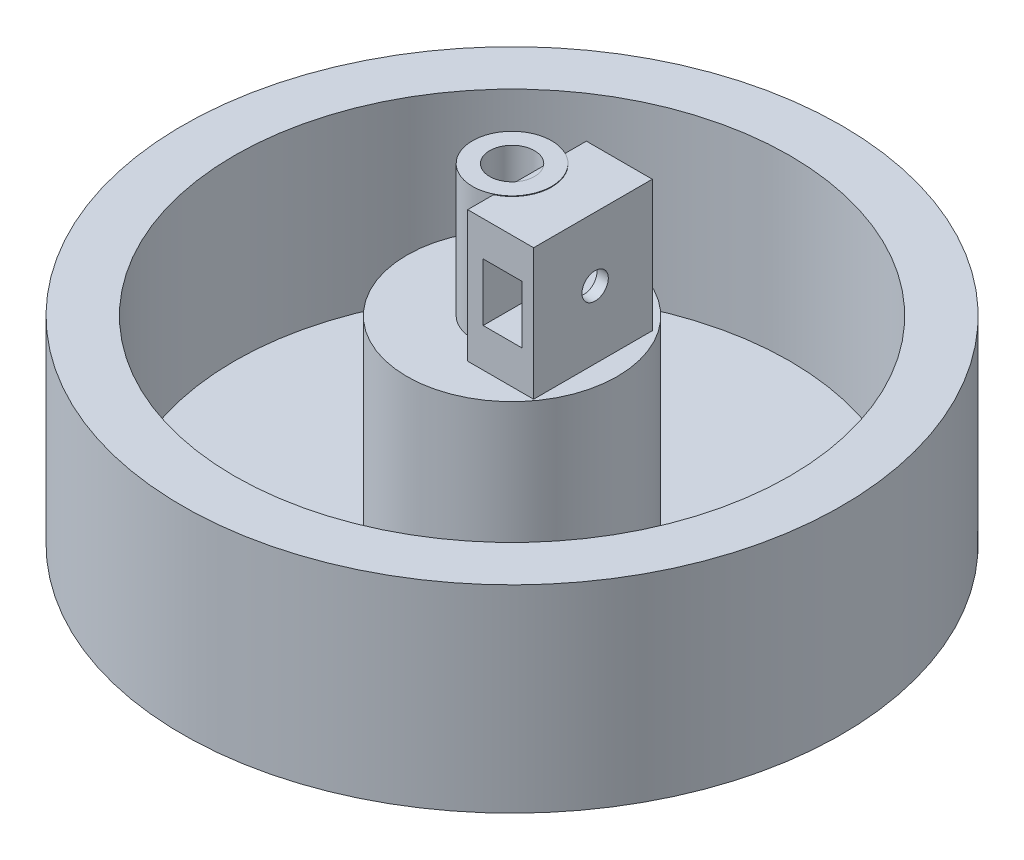
ISO-10303-21;
HEADER;
FILE_DESCRIPTION(('STEP AP214'),'2;1');
FILE_NAME('part.step','',(''),(''),'','','');
FILE_SCHEMA(('AUTOMOTIVE_DESIGN { 1 0 10303 214 1 1 1 1 }'));
ENDSEC;
DATA;
#1=APPLICATION_CONTEXT('core data for automotive mechanical design processes');
#2=APPLICATION_PROTOCOL_DEFINITION('international standard','automotive_design',2000,#1);
#3=PRODUCT_CONTEXT('',#1,'mechanical');
#4=PRODUCT('Part','Part','',(#3));
#5=PRODUCT_RELATED_PRODUCT_CATEGORY('part','',(#4));
#6=PRODUCT_DEFINITION_FORMATION('','',#4);
#7=PRODUCT_DEFINITION_CONTEXT('part definition',#1,'design');
#8=PRODUCT_DEFINITION('design','',#6,#7);
#9=PRODUCT_DEFINITION_SHAPE('','',#8);
#10=(LENGTH_UNIT() NAMED_UNIT(*) SI_UNIT(.MILLI.,.METRE.));
#11=(NAMED_UNIT(*) PLANE_ANGLE_UNIT() SI_UNIT($,.RADIAN.));
#12=(NAMED_UNIT(*) SI_UNIT($,.STERADIAN.) SOLID_ANGLE_UNIT());
#13=UNCERTAINTY_MEASURE_WITH_UNIT(LENGTH_MEASURE(1.E-05),#10,'distance_accuracy_value','');
#14=(GEOMETRIC_REPRESENTATION_CONTEXT(3) GLOBAL_UNCERTAINTY_ASSIGNED_CONTEXT((#13)) GLOBAL_UNIT_ASSIGNED_CONTEXT((#10,
#11,#12)) REPRESENTATION_CONTEXT('',''));
#15=CARTESIAN_POINT('',(0.,0.,0.));
#16=DIRECTION('',(0.,0.,1.));
#17=DIRECTION('',(1.,0.,0.));
#18=AXIS2_PLACEMENT_3D('',#15,#16,#17);
#19=CARTESIAN_POINT('',(0.,0.,0.));
#20=DIRECTION('',(0.,-1.,0.));
#21=DIRECTION('',(0.,0.,-1.));
#22=AXIS2_PLACEMENT_3D('',#19,#20,#21);
#23=PLANE('',#22);
#24=DIRECTION('',(0.,0.,1.));
#25=VECTOR('',#24,1.);
#26=CARTESIAN_POINT('',(2.6,0.,-8.67171590872573));
#27=LINE('',#26,#25);
#28=CARTESIAN_POINT('',(2.6,0.,5.40740233383831));
#29=VERTEX_POINT('',#28);
#30=CARTESIAN_POINT('',(2.6,0.,9.3322603304955));
#31=VERTEX_POINT('',#30);
#32=EDGE_CURVE('E159',#29,#31,#27,.T.);
#33=ORIENTED_EDGE('',*,*,#32,.F.);
#34=CARTESIAN_POINT('',(0.,0.,0.));
#35=DIRECTION('',(0.,1.,0.));
#36=DIRECTION('',(0.,0.,1.));
#37=AXIS2_PLACEMENT_3D('',#34,#35,#36);
#38=CIRCLE('',#37,6.);
#39=CARTESIAN_POINT('',(2.6,0.,-5.40740233383831));
#40=VERTEX_POINT('',#39);
#41=EDGE_CURVE('E189',#40,#29,#38,.T.);
#42=ORIENTED_EDGE('',*,*,#41,.F.);
#43=CARTESIAN_POINT('',(2.6,0.,-8.67171590872573));
#44=VERTEX_POINT('',#43);
#45=EDGE_CURVE('E161',#44,#40,#27,.T.);
#46=ORIENTED_EDGE('',*,*,#45,.F.);
#47=DIRECTION('',(-1.,0.,0.));
#48=VECTOR('',#47,1.);
#49=CARTESIAN_POINT('',(12.6,0.,-8.67171590872573));
#50=LINE('',#49,#48);
#51=CARTESIAN_POINT('',(12.6,0.,-8.67171590872573));
#52=VERTEX_POINT('',#51);
#53=EDGE_CURVE('E144',#52,#44,#50,.T.);
#54=ORIENTED_EDGE('',*,*,#53,.F.);
#55=DIRECTION('',(0.,0.,1.));
#56=VECTOR('',#55,1.);
#57=CARTESIAN_POINT('',(12.6,0.,-8.67171590872573));
#58=LINE('',#57,#56);
#59=CARTESIAN_POINT('',(12.6,0.,9.3322603304955));
#60=VERTEX_POINT('',#59);
#61=EDGE_CURVE('E128',#52,#60,#58,.T.);
#62=ORIENTED_EDGE('',*,*,#61,.T.);
#63=DIRECTION('',(-1.,0.,0.));
#64=VECTOR('',#63,1.);
#65=CARTESIAN_POINT('',(12.6,0.,9.3322603304955));
#66=LINE('',#65,#64);
#67=EDGE_CURVE('E136',#60,#31,#66,.T.);
#68=ORIENTED_EDGE('',*,*,#67,.T.);
#69=EDGE_LOOP('',(#33,#42,#46,#54,#62,#68));
#70=FACE_BOUND('',#69,.T.);
#71=CARTESIAN_POINT('',(0.,0.,0.));
#72=DIRECTION('',(0.,1.,0.));
#73=DIRECTION('',(0.,0.,1.));
#74=AXIS2_PLACEMENT_3D('',#71,#72,#73);
#75=CIRCLE('',#74,15.9579008899185);
#76=CARTESIAN_POINT('',(0.,0.,15.9579008899185));
#77=VERTEX_POINT('',#76);
#78=EDGE_CURVE('E313',#77,#77,#75,.T.);
#79=ORIENTED_EDGE('',*,*,#78,.T.);
#80=EDGE_LOOP('',(#79));
#81=FACE_BOUND('',#80,.T.);
#82=ADVANCED_FACE('F35',(#70,#81),#23,.F.);
#83=CARTESIAN_POINT('',(12.6,19.9099600410235,-8.67171590872573));
#84=DIRECTION('',(0.,0.,-1.));
#85=DIRECTION('',(0.,1.,0.));
#86=AXIS2_PLACEMENT_3D('',#83,#84,#85);
#87=PLANE('',#86);
#88=DIRECTION('',(0.,-1.,0.));
#89=VECTOR('',#88,1.);
#90=CARTESIAN_POINT('',(2.6,19.9099600410235,-8.67171590872573));
#91=LINE('',#90,#89);
#92=CARTESIAN_POINT('',(2.6,19.9099600410235,-8.67171590872573));
#93=VERTEX_POINT('',#92);
#94=EDGE_CURVE('E156',#93,#44,#91,.T.);
#95=ORIENTED_EDGE('',*,*,#94,.F.);
#96=DIRECTION('',(-1.,0.,0.));
#97=VECTOR('',#96,1.);
#98=CARTESIAN_POINT('',(12.6,19.9099600410235,-8.67171590872573));
#99=LINE('',#98,#97);
#100=CARTESIAN_POINT('',(12.6,19.9099600410235,-8.67171590872573));
#101=VERTEX_POINT('',#100);
#102=EDGE_CURVE('E167',#101,#93,#99,.T.);
#103=ORIENTED_EDGE('',*,*,#102,.F.);
#104=DIRECTION('',(0.,-1.,0.));
#105=VECTOR('',#104,1.);
#106=CARTESIAN_POINT('',(12.6,19.9099600410235,-8.67171590872573));
#107=LINE('',#106,#105);
#108=EDGE_CURVE('E149',#101,#52,#107,.T.);
#109=ORIENTED_EDGE('',*,*,#108,.T.);
#110=ORIENTED_EDGE('',*,*,#53,.T.);
#111=EDGE_LOOP('',(#95,#103,#109,#110));
#112=FACE_BOUND('',#111,.T.);
#113=DIRECTION('',(0.,1.,0.));
#114=VECTOR('',#113,1.);
#115=CARTESIAN_POINT('',(10.8765163816997,19.9099600410235,-8.67171590872573));
#116=LINE('',#115,#114);
#117=CARTESIAN_POINT('',(10.8765163816997,5.86192553685862,-8.67171590872573));
#118=VERTEX_POINT('',#117);
#119=CARTESIAN_POINT('',(10.8765163816997,14.6143324449,-8.67171590872573));
#120=VERTEX_POINT('',#119);
#121=EDGE_CURVE('E214',#118,#120,#116,.T.);
#122=ORIENTED_EDGE('',*,*,#121,.T.);
#123=DIRECTION('',(-1.,0.,0.));
#124=VECTOR('',#123,1.);
#125=CARTESIAN_POINT('',(12.6,14.6143324449,-8.67171590872573));
#126=LINE('',#125,#124);
#127=CARTESIAN_POINT('',(4.94343022694287,14.6143324449,-8.67171590872573));
#128=VERTEX_POINT('',#127);
#129=EDGE_CURVE('E206',#120,#128,#126,.T.);
#130=ORIENTED_EDGE('',*,*,#129,.T.);
#131=DIRECTION('',(0.,-1.,0.));
#132=VECTOR('',#131,1.);
#133=CARTESIAN_POINT('',(4.94343022694287,19.9099600410235,-8.67171590872573));
#134=LINE('',#133,#132);
#135=CARTESIAN_POINT('',(4.94343022694287,5.86192553685862,-8.67171590872573));
#136=VERTEX_POINT('',#135);
#137=EDGE_CURVE('E240',#128,#136,#134,.T.);
#138=ORIENTED_EDGE('',*,*,#137,.T.);
#139=DIRECTION('',(1.,0.,0.));
#140=VECTOR('',#139,1.);
#141=CARTESIAN_POINT('',(12.6,5.86192553685862,-8.67171590872573));
#142=LINE('',#141,#140);
#143=EDGE_CURVE('E224',#136,#118,#142,.T.);
#144=ORIENTED_EDGE('',*,*,#143,.T.);
#145=EDGE_LOOP('',(#122,#130,#138,#144));
#146=FACE_BOUND('',#145,.T.);
#147=ADVANCED_FACE('F264',(#112,#146),#87,.T.);
#148=CARTESIAN_POINT('',(12.6,19.9099600410235,9.3322603304955));
#149=DIRECTION('',(0.,0.,1.));
#150=DIRECTION('',(0.,-1.,0.));
#151=AXIS2_PLACEMENT_3D('',#148,#149,#150);
#152=PLANE('',#151);
#153=DIRECTION('',(0.,1.,0.));
#154=VECTOR('',#153,1.);
#155=CARTESIAN_POINT('',(2.6,19.9099600410235,9.3322603304955));
#156=LINE('',#155,#154);
#157=CARTESIAN_POINT('',(2.6,19.9099600410235,9.3322603304955));
#158=VERTEX_POINT('',#157);
#159=EDGE_CURVE('E140',#31,#158,#156,.T.);
#160=ORIENTED_EDGE('',*,*,#159,.F.);
#161=ORIENTED_EDGE('',*,*,#67,.F.);
#162=DIRECTION('',(0.,1.,0.));
#163=VECTOR('',#162,1.);
#164=CARTESIAN_POINT('',(12.6,19.9099600410235,9.3322603304955));
#165=LINE('',#164,#163);
#166=CARTESIAN_POINT('',(12.6,19.9099600410235,9.3322603304955));
#167=VERTEX_POINT('',#166);
#168=EDGE_CURVE('E123',#60,#167,#165,.T.);
#169=ORIENTED_EDGE('',*,*,#168,.T.);
#170=DIRECTION('',(-1.,0.,0.));
#171=VECTOR('',#170,1.);
#172=CARTESIAN_POINT('',(12.6,19.9099600410235,9.3322603304955));
#173=LINE('',#172,#171);
#174=EDGE_CURVE('E143',#167,#158,#173,.T.);
#175=ORIENTED_EDGE('',*,*,#174,.T.);
#176=EDGE_LOOP('',(#160,#161,#169,#175));
#177=FACE_BOUND('',#176,.T.);
#178=DIRECTION('',(0.,1.,0.));
#179=VECTOR('',#178,1.);
#180=CARTESIAN_POINT('',(4.94343022694287,19.9099600410235,9.3322603304955));
#181=LINE('',#180,#179);
#182=CARTESIAN_POINT('',(4.94343022694287,5.86192553685862,9.3322603304955));
#183=VERTEX_POINT('',#182);
#184=CARTESIAN_POINT('',(4.94343022694287,14.6143324449,9.3322603304955));
#185=VERTEX_POINT('',#184);
#186=EDGE_CURVE('E213',#183,#185,#181,.T.);
#187=ORIENTED_EDGE('',*,*,#186,.T.);
#188=DIRECTION('',(1.,0.,0.));
#189=VECTOR('',#188,1.);
#190=CARTESIAN_POINT('',(12.6,14.6143324449,9.3322603304955));
#191=LINE('',#190,#189);
#192=CARTESIAN_POINT('',(10.8765163816997,14.6143324449,9.3322603304955));
#193=VERTEX_POINT('',#192);
#194=EDGE_CURVE('E11',#185,#193,#191,.T.);
#195=ORIENTED_EDGE('',*,*,#194,.T.);
#196=DIRECTION('',(0.,-1.,0.));
#197=VECTOR('',#196,1.);
#198=CARTESIAN_POINT('',(10.8765163816997,19.9099600410235,9.3322603304955));
#199=LINE('',#198,#197);
#200=CARTESIAN_POINT('',(10.8765163816997,5.86192553685862,9.3322603304955));
#201=VERTEX_POINT('',#200);
#202=EDGE_CURVE('E210',#193,#201,#199,.T.);
#203=ORIENTED_EDGE('',*,*,#202,.T.);
#204=DIRECTION('',(-1.,0.,0.));
#205=VECTOR('',#204,1.);
#206=CARTESIAN_POINT('',(12.6,5.86192553685862,9.3322603304955));
#207=LINE('',#206,#205);
#208=EDGE_CURVE('E43',#201,#183,#207,.T.);
#209=ORIENTED_EDGE('',*,*,#208,.T.);
#210=EDGE_LOOP('',(#187,#195,#203,#209));
#211=FACE_BOUND('',#210,.T.);
#212=ADVANCED_FACE('F137',(#177,#211),#152,.T.);
#213=CARTESIAN_POINT('',(1.6,10.2369255368586,0.));
#214=DIRECTION('',(1.,0.,0.));
#215=DIRECTION('',(0.,0.,-1.));
#216=AXIS2_PLACEMENT_3D('',#213,#214,#215);
#217=CYLINDRICAL_SURFACE('',#216,2.);
#218=CARTESIAN_POINT('',(2.6,10.2369255368586,0.));
#219=DIRECTION('',(-1.,0.,0.));
#220=DIRECTION('',(0.,0.,1.));
#221=AXIS2_PLACEMENT_3D('',#218,#219,#220);
#222=CIRCLE('',#221,2.);
#223=CARTESIAN_POINT('',(2.6,10.2369255368586,2.));
#224=VERTEX_POINT('',#223);
#225=EDGE_CURVE('E160',#224,#224,#222,.F.);
#226=ORIENTED_EDGE('',*,*,#225,.F.);
#227=EDGE_LOOP('',(#226));
#228=FACE_BOUND('',#227,.T.);
#229=CARTESIAN_POINT('',(4.94343022694287,10.2369255368586,0.));
#230=DIRECTION('',(1.,0.,0.));
#231=DIRECTION('',(0.,0.,-1.));
#232=AXIS2_PLACEMENT_3D('',#229,#230,#231);
#233=CIRCLE('',#232,2.);
#234=CARTESIAN_POINT('',(4.94343022694287,10.2369255368586,-2.));
#235=VERTEX_POINT('',#234);
#236=EDGE_CURVE('E211',#235,#235,#233,.T.);
#237=ORIENTED_EDGE('',*,*,#236,.T.);
#238=EDGE_LOOP('',(#237));
#239=FACE_BOUND('',#238,.T.);
#240=ADVANCED_FACE('F250',(#228,#239),#217,.F.);
#241=CARTESIAN_POINT('',(12.6,10.2369255368586,0.));
#242=DIRECTION('',(-1.,0.,0.));
#243=DIRECTION('',(0.,0.,1.));
#244=AXIS2_PLACEMENT_3D('',#241,#242,#243);
#245=CIRCLE('',#244,2.);
#246=CARTESIAN_POINT('',(12.6,10.2369255368586,2.));
#247=VERTEX_POINT('',#246);
#248=EDGE_CURVE('E203',#247,#247,#245,.F.);
#249=ORIENTED_EDGE('',*,*,#248,.T.);
#250=EDGE_LOOP('',(#249));
#251=FACE_BOUND('',#250,.T.);
#252=CARTESIAN_POINT('',(10.8765163816997,10.2369255368586,0.));
#253=DIRECTION('',(-1.,0.,0.));
#254=DIRECTION('',(0.,0.,1.));
#255=AXIS2_PLACEMENT_3D('',#252,#253,#254);
#256=CIRCLE('',#255,2.);
#257=CARTESIAN_POINT('',(10.8765163816997,10.2369255368586,2.));
#258=VERTEX_POINT('',#257);
#259=EDGE_CURVE('E207',#258,#258,#256,.T.);
#260=ORIENTED_EDGE('',*,*,#259,.T.);
#261=EDGE_LOOP('',(#260));
#262=FACE_BOUND('',#261,.T.);
#263=ADVANCED_FACE('F253',(#251,#262),#217,.F.);
#264=CARTESIAN_POINT('',(0.,20.,0.));
#265=DIRECTION('',(0.,-1.,0.));
#266=DIRECTION('',(0.,0.,-1.));
#267=AXIS2_PLACEMENT_3D('',#264,#265,#266);
#268=CYLINDRICAL_SURFACE('',#267,6.);
#269=CARTESIAN_POINT('',(0.,20.,0.));
#270=DIRECTION('',(0.,1.,0.));
#271=DIRECTION('',(0.,0.,1.));
#272=AXIS2_PLACEMENT_3D('',#269,#270,#271);
#273=CIRCLE('',#272,6.);
#274=CARTESIAN_POINT('',(0.,20.,6.));
#275=VERTEX_POINT('',#274);
#276=EDGE_CURVE('E192',#275,#275,#273,.T.);
#277=ORIENTED_EDGE('',*,*,#276,.F.);
#278=EDGE_LOOP('',(#277));
#279=FACE_BOUND('',#278,.T.);
#280=CARTESIAN_POINT('',(0.,19.9099600410235,0.));
#281=DIRECTION('',(0.,1.,0.));
#282=DIRECTION('',(0.,0.,1.));
#283=AXIS2_PLACEMENT_3D('',#280,#281,#282);
#284=CIRCLE('',#283,6.);
#285=CARTESIAN_POINT('',(2.6,19.9099600410235,5.40740233383831));
#286=VERTEX_POINT('',#285);
#287=CARTESIAN_POINT('',(2.6,19.9099600410235,-5.40740233383831));
#288=VERTEX_POINT('',#287);
#289=EDGE_CURVE('E178',#286,#288,#284,.T.);
#290=ORIENTED_EDGE('',*,*,#289,.T.);
#291=DIRECTION('',(0.,-1.,0.));
#292=VECTOR('',#291,1.);
#293=CARTESIAN_POINT('',(2.6,20.,-5.40740233383831));
#294=LINE('',#293,#292);
#295=EDGE_CURVE('E175',#288,#40,#294,.T.);
#296=ORIENTED_EDGE('',*,*,#295,.T.);
#297=ORIENTED_EDGE('',*,*,#41,.T.);
#298=DIRECTION('',(0.,-1.,0.));
#299=VECTOR('',#298,1.);
#300=CARTESIAN_POINT('',(2.6,20.,5.40740233383831));
#301=LINE('',#300,#299);
#302=EDGE_CURVE('E170',#29,#286,#301,.F.);
#303=ORIENTED_EDGE('',*,*,#302,.T.);
#304=EDGE_LOOP('',(#290,#296,#297,#303));
#305=FACE_BOUND('',#304,.T.);
#306=ADVANCED_FACE('F37',(#279,#305),#268,.T.);
#307=CARTESIAN_POINT('',(0.,20.,0.));
#308=DIRECTION('',(0.,1.,0.));
#309=DIRECTION('',(0.,0.,1.));
#310=AXIS2_PLACEMENT_3D('',#307,#308,#309);
#311=PLANE('',#310);
#312=CARTESIAN_POINT('',(0.,20.,0.));
#313=DIRECTION('',(0.,1.,0.));
#314=DIRECTION('',(0.,0.,1.));
#315=AXIS2_PLACEMENT_3D('',#312,#313,#314);
#316=CIRCLE('',#315,3.4);
#317=CARTESIAN_POINT('',(0.,20.,3.4));
#318=VERTEX_POINT('',#317);
#319=EDGE_CURVE('E186',#318,#318,#316,.T.);
#320=ORIENTED_EDGE('',*,*,#319,.F.);
#321=EDGE_LOOP('',(#320));
#322=FACE_BOUND('',#321,.T.);
#323=ORIENTED_EDGE('',*,*,#276,.T.);
#324=EDGE_LOOP('',(#323));
#325=FACE_BOUND('',#324,.T.);
#326=ADVANCED_FACE('F385',(#322,#325),#311,.T.);
#327=CARTESIAN_POINT('',(0.,6.45,0.));
#328=DIRECTION('',(0.,1.,0.));
#329=DIRECTION('',(0.,0.,1.));
#330=AXIS2_PLACEMENT_3D('',#327,#328,#329);
#331=CYLINDRICAL_SURFACE('',#330,3.4);
#332=CARTESIAN_POINT('',(0.,19.9099600410235,0.));
#333=DIRECTION('',(0.,1.,0.));
#334=DIRECTION('',(0.,0.,1.));
#335=AXIS2_PLACEMENT_3D('',#332,#333,#334);
#336=CIRCLE('',#335,3.4);
#337=CARTESIAN_POINT('',(2.6,19.9099600410235,-2.19089023002066));
#338=VERTEX_POINT('',#337);
#339=CARTESIAN_POINT('',(2.6,19.9099600410235,2.19089023002066));
#340=VERTEX_POINT('',#339);
#341=EDGE_CURVE('E200',#338,#340,#336,.F.);
#342=ORIENTED_EDGE('',*,*,#341,.T.);
#343=DIRECTION('',(0.,1.,0.));
#344=VECTOR('',#343,1.);
#345=CARTESIAN_POINT('',(2.6,6.45,2.19089023002067));
#346=LINE('',#345,#344);
#347=CARTESIAN_POINT('',(2.6,6.45,2.19089023002066));
#348=VERTEX_POINT('',#347);
#349=EDGE_CURVE('E183',#340,#348,#346,.F.);
#350=ORIENTED_EDGE('',*,*,#349,.T.);
#351=CARTESIAN_POINT('',(0.,6.45,0.));
#352=DIRECTION('',(0.,1.,0.));
#353=DIRECTION('',(0.,0.,1.));
#354=AXIS2_PLACEMENT_3D('',#351,#352,#353);
#355=CIRCLE('',#354,3.4);
#356=CARTESIAN_POINT('',(2.6,6.45,-2.19089023002066));
#357=VERTEX_POINT('',#356);
#358=EDGE_CURVE('E187',#357,#348,#355,.T.);
#359=ORIENTED_EDGE('',*,*,#358,.F.);
#360=DIRECTION('',(0.,1.,0.));
#361=VECTOR('',#360,1.);
#362=CARTESIAN_POINT('',(2.6,6.45,-2.19089023002067));
#363=LINE('',#362,#361);
#364=EDGE_CURVE('E181',#357,#338,#363,.T.);
#365=ORIENTED_EDGE('',*,*,#364,.T.);
#366=EDGE_LOOP('',(#342,#350,#359,#365));
#367=FACE_BOUND('',#366,.T.);
#368=ORIENTED_EDGE('',*,*,#319,.T.);
#369=EDGE_LOOP('',(#368));
#370=FACE_BOUND('',#369,.T.);
#371=ADVANCED_FACE('F471',(#367,#370),#331,.F.);
#372=CARTESIAN_POINT('',(0.,6.45,0.));
#373=DIRECTION('',(0.,1.,0.));
#374=DIRECTION('',(0.,0.,1.));
#375=AXIS2_PLACEMENT_3D('',#372,#373,#374);
#376=PLANE('',#375);
#377=DIRECTION('',(0.,0.,1.));
#378=VECTOR('',#377,1.);
#379=CARTESIAN_POINT('',(2.6,6.45,0.));
#380=LINE('',#379,#378);
#381=EDGE_CURVE('E195',#357,#348,#380,.T.);
#382=ORIENTED_EDGE('',*,*,#381,.F.);
#383=ORIENTED_EDGE('',*,*,#358,.T.);
#384=EDGE_LOOP('',(#382,#383));
#385=FACE_BOUND('',#384,.T.);
#386=ADVANCED_FACE('F449',(#385),#376,.T.);
#387=CARTESIAN_POINT('',(2.6,4.71,3.57158819939229));
#388=DIRECTION('',(-1.,0.,0.));
#389=DIRECTION('',(0.,0.,1.));
#390=AXIS2_PLACEMENT_3D('',#387,#388,#389);
#391=PLANE('',#390);
#392=ORIENTED_EDGE('',*,*,#225,.T.);
#393=EDGE_LOOP('',(#392));
#394=FACE_BOUND('',#393,.T.);
#395=ORIENTED_EDGE('',*,*,#349,.F.);
#396=DIRECTION('',(0.,0.,-1.));
#397=VECTOR('',#396,1.);
#398=CARTESIAN_POINT('',(2.6,19.9099600410235,-8.67171590872573));
#399=LINE('',#398,#397);
#400=EDGE_CURVE('E166',#340,#338,#399,.T.);
#401=ORIENTED_EDGE('',*,*,#400,.T.);
#402=ORIENTED_EDGE('',*,*,#364,.F.);
#403=ORIENTED_EDGE('',*,*,#381,.T.);
#404=EDGE_LOOP('',(#395,#401,#402,#403));
#405=FACE_BOUND('',#404,.T.);
#406=ADVANCED_FACE('F247',(#394,#405),#391,.T.);
#407=CARTESIAN_POINT('',(12.6,19.9099600410235,-8.67171590872573));
#408=DIRECTION('',(0.,1.,0.));
#409=DIRECTION('',(0.,0.,1.));
#410=AXIS2_PLACEMENT_3D('',#407,#408,#409);
#411=PLANE('',#410);
#412=ORIENTED_EDGE('',*,*,#341,.F.);
#413=ORIENTED_EDGE('',*,*,#400,.F.);
#414=EDGE_LOOP('',(#412,#413));
#415=FACE_BOUND('',#414,.T.);
#416=ADVANCED_FACE('F448',(#415),#411,.T.);
#417=ORIENTED_EDGE('',*,*,#289,.F.);
#418=EDGE_CURVE('E151',#158,#286,#399,.T.);
#419=ORIENTED_EDGE('',*,*,#418,.F.);
#420=ORIENTED_EDGE('',*,*,#174,.F.);
#421=DIRECTION('',(0.,0.,-1.));
#422=VECTOR('',#421,1.);
#423=CARTESIAN_POINT('',(12.6,19.9099600410235,-8.67171590872573));
#424=LINE('',#423,#422);
#425=EDGE_CURVE('E131',#167,#101,#424,.T.);
#426=ORIENTED_EDGE('',*,*,#425,.T.);
#427=ORIENTED_EDGE('',*,*,#102,.T.);
#428=EDGE_CURVE('E164',#288,#93,#399,.T.);
#429=ORIENTED_EDGE('',*,*,#428,.F.);
#430=EDGE_LOOP('',(#417,#419,#420,#426,#427,#429));
#431=FACE_BOUND('',#430,.T.);
#432=ADVANCED_FACE('F374',(#431),#411,.T.);
#433=CARTESIAN_POINT('',(2.6,0.,0.));
#434=DIRECTION('',(-1.,0.,0.));
#435=DIRECTION('',(0.,0.,1.));
#436=AXIS2_PLACEMENT_3D('',#433,#434,#435);
#437=PLANE('',#436);
#438=ORIENTED_EDGE('',*,*,#295,.F.);
#439=ORIENTED_EDGE('',*,*,#428,.T.);
#440=ORIENTED_EDGE('',*,*,#94,.T.);
#441=ORIENTED_EDGE('',*,*,#45,.T.);
#442=EDGE_LOOP('',(#438,#439,#440,#441));
#443=FACE_BOUND('',#442,.T.);
#444=ADVANCED_FACE('F364',(#443),#437,.T.);
#445=ORIENTED_EDGE('',*,*,#302,.F.);
#446=ORIENTED_EDGE('',*,*,#32,.T.);
#447=ORIENTED_EDGE('',*,*,#159,.T.);
#448=ORIENTED_EDGE('',*,*,#418,.T.);
#449=EDGE_LOOP('',(#445,#446,#447,#448));
#450=FACE_BOUND('',#449,.T.);
#451=ADVANCED_FACE('F352',(#450),#437,.T.);
#452=CARTESIAN_POINT('',(12.6,0.,0.));
#453=DIRECTION('',(-1.,0.,0.));
#454=DIRECTION('',(0.,0.,1.));
#455=AXIS2_PLACEMENT_3D('',#452,#453,#454);
#456=PLANE('',#455);
#457=ORIENTED_EDGE('',*,*,#248,.F.);
#458=EDGE_LOOP('',(#457));
#459=FACE_BOUND('',#458,.T.);
#460=ORIENTED_EDGE('',*,*,#108,.F.);
#461=ORIENTED_EDGE('',*,*,#425,.F.);
#462=ORIENTED_EDGE('',*,*,#168,.F.);
#463=ORIENTED_EDGE('',*,*,#61,.F.);
#464=EDGE_LOOP('',(#460,#461,#462,#463));
#465=FACE_BOUND('',#464,.T.);
#466=ADVANCED_FACE('F126',(#459,#465),#456,.F.);
#467=CARTESIAN_POINT('',(4.94343022694287,14.6143324449,10.));
#468=DIRECTION('',(0.,-1.,0.));
#469=DIRECTION('',(0.,0.,-1.));
#470=AXIS2_PLACEMENT_3D('',#467,#468,#469);
#471=PLANE('',#470);
#472=DIRECTION('',(0.,0.,-1.));
#473=VECTOR('',#472,1.);
#474=CARTESIAN_POINT('',(10.8765163816997,14.6143324449,10.));
#475=LINE('',#474,#473);
#476=EDGE_CURVE('E50',#193,#120,#475,.T.);
#477=ORIENTED_EDGE('',*,*,#476,.F.);
#478=ORIENTED_EDGE('',*,*,#194,.F.);
#479=DIRECTION('',(0.,0.,-1.));
#480=VECTOR('',#479,1.);
#481=CARTESIAN_POINT('',(4.94343022694287,14.6143324449,10.));
#482=LINE('',#481,#480);
#483=EDGE_CURVE('E227',#185,#128,#482,.T.);
#484=ORIENTED_EDGE('',*,*,#483,.T.);
#485=ORIENTED_EDGE('',*,*,#129,.F.);
#486=EDGE_LOOP('',(#477,#478,#484,#485));
#487=FACE_BOUND('',#486,.T.);
#488=ADVANCED_FACE('F259',(#487),#471,.T.);
#489=CARTESIAN_POINT('',(4.94343022694287,5.86192553685862,10.));
#490=DIRECTION('',(1.,0.,0.));
#491=DIRECTION('',(0.,0.,-1.));
#492=AXIS2_PLACEMENT_3D('',#489,#490,#491);
#493=PLANE('',#492);
#494=ORIENTED_EDGE('',*,*,#236,.F.);
#495=EDGE_LOOP('',(#494));
#496=FACE_BOUND('',#495,.T.);
#497=ORIENTED_EDGE('',*,*,#483,.F.);
#498=ORIENTED_EDGE('',*,*,#186,.F.);
#499=DIRECTION('',(0.,0.,-1.));
#500=VECTOR('',#499,1.);
#501=CARTESIAN_POINT('',(4.94343022694287,5.86192553685862,10.));
#502=LINE('',#501,#500);
#503=EDGE_CURVE('E223',#183,#136,#502,.T.);
#504=ORIENTED_EDGE('',*,*,#503,.T.);
#505=ORIENTED_EDGE('',*,*,#137,.F.);
#506=EDGE_LOOP('',(#497,#498,#504,#505));
#507=FACE_BOUND('',#506,.T.);
#508=ADVANCED_FACE('F257',(#496,#507),#493,.T.);
#509=CARTESIAN_POINT('',(4.94343022694287,5.86192553685862,10.));
#510=DIRECTION('',(0.,1.,0.));
#511=DIRECTION('',(0.,0.,1.));
#512=AXIS2_PLACEMENT_3D('',#509,#510,#511);
#513=PLANE('',#512);
#514=ORIENTED_EDGE('',*,*,#503,.F.);
#515=ORIENTED_EDGE('',*,*,#208,.F.);
#516=DIRECTION('',(0.,0.,-1.));
#517=VECTOR('',#516,1.);
#518=CARTESIAN_POINT('',(10.8765163816997,5.86192553685862,10.));
#519=LINE('',#518,#517);
#520=EDGE_CURVE('E55',#201,#118,#519,.T.);
#521=ORIENTED_EDGE('',*,*,#520,.T.);
#522=ORIENTED_EDGE('',*,*,#143,.F.);
#523=EDGE_LOOP('',(#514,#515,#521,#522));
#524=FACE_BOUND('',#523,.T.);
#525=ADVANCED_FACE('F220',(#524),#513,.T.);
#526=CARTESIAN_POINT('',(10.8765163816997,10.2369255368586,10.));
#527=DIRECTION('',(-1.,0.,0.));
#528=DIRECTION('',(0.,0.,1.));
#529=AXIS2_PLACEMENT_3D('',#526,#527,#528);
#530=PLANE('',#529);
#531=ORIENTED_EDGE('',*,*,#259,.F.);
#532=EDGE_LOOP('',(#531));
#533=FACE_BOUND('',#532,.T.);
#534=ORIENTED_EDGE('',*,*,#520,.F.);
#535=ORIENTED_EDGE('',*,*,#202,.F.);
#536=ORIENTED_EDGE('',*,*,#476,.T.);
#537=ORIENTED_EDGE('',*,*,#121,.F.);
#538=EDGE_LOOP('',(#534,#535,#536,#537));
#539=FACE_BOUND('',#538,.T.);
#540=ADVANCED_FACE('F265',(#533,#539),#530,.T.);
#541=CARTESIAN_POINT('',(0.,-27.,0.));
#542=DIRECTION('',(0.,1.,0.));
#543=DIRECTION('',(0.,0.,1.));
#544=AXIS2_PLACEMENT_3D('',#541,#542,#543);
#545=CYLINDRICAL_SURFACE('',#544,42.1243665125487);
#546=CARTESIAN_POINT('',(0.,-27.,0.));
#547=DIRECTION('',(0.,1.,0.));
#548=DIRECTION('',(0.,0.,1.));
#549=AXIS2_PLACEMENT_3D('',#546,#547,#548);
#550=CIRCLE('',#549,42.1243665125487);
#551=CARTESIAN_POINT('',(0.,-27.,42.1243665125487));
#552=VERTEX_POINT('',#551);
#553=EDGE_CURVE('E305',#552,#552,#550,.T.);
#554=ORIENTED_EDGE('',*,*,#553,.F.);
#555=EDGE_LOOP('',(#554));
#556=FACE_BOUND('',#555,.T.);
#557=CARTESIAN_POINT('',(0.,0.,0.));
#558=DIRECTION('',(0.,1.,0.));
#559=DIRECTION('',(0.,0.,1.));
#560=AXIS2_PLACEMENT_3D('',#557,#558,#559);
#561=CIRCLE('',#560,42.1243665125487);
#562=CARTESIAN_POINT('',(0.,0.,42.1243665125487));
#563=VERTEX_POINT('',#562);
#564=EDGE_CURVE('E300',#563,#563,#561,.T.);
#565=ORIENTED_EDGE('',*,*,#564,.T.);
#566=EDGE_LOOP('',(#565));
#567=FACE_BOUND('',#566,.T.);
#568=ADVANCED_FACE('F267',(#556,#567),#545,.F.);
#569=CARTESIAN_POINT('',(0.,-27.,0.));
#570=DIRECTION('',(0.,1.,0.));
#571=DIRECTION('',(0.,0.,1.));
#572=AXIS2_PLACEMENT_3D('',#569,#570,#571);
#573=PLANE('',#572);
#574=CARTESIAN_POINT('',(0.,-27.,0.));
#575=DIRECTION('',(0.,1.,0.));
#576=DIRECTION('',(0.,0.,1.));
#577=AXIS2_PLACEMENT_3D('',#574,#575,#576);
#578=CIRCLE('',#577,15.9579008899185);
#579=CARTESIAN_POINT('',(0.,-27.,15.9579008899185));
#580=VERTEX_POINT('',#579);
#581=EDGE_CURVE('E311',#580,#580,#578,.T.);
#582=ORIENTED_EDGE('',*,*,#581,.F.);
#583=EDGE_LOOP('',(#582));
#584=FACE_BOUND('',#583,.T.);
#585=ORIENTED_EDGE('',*,*,#553,.T.);
#586=EDGE_LOOP('',(#585));
#587=FACE_BOUND('',#586,.T.);
#588=ADVANCED_FACE('F274',(#584,#587),#573,.T.);
#589=CARTESIAN_POINT('',(0.,-27.,0.));
#590=DIRECTION('',(0.,1.,0.));
#591=DIRECTION('',(0.,0.,1.));
#592=AXIS2_PLACEMENT_3D('',#589,#590,#591);
#593=CYLINDRICAL_SURFACE('',#592,15.9579008899185);
#594=ORIENTED_EDGE('',*,*,#581,.T.);
#595=EDGE_LOOP('',(#594));
#596=FACE_BOUND('',#595,.T.);
#597=ORIENTED_EDGE('',*,*,#78,.F.);
#598=EDGE_LOOP('',(#597));
#599=FACE_BOUND('',#598,.T.);
#600=ADVANCED_FACE('F319',(#596,#599),#593,.T.);
#601=CARTESIAN_POINT('',(0.,-30.,0.));
#602=DIRECTION('',(0.,-1.,0.));
#603=DIRECTION('',(0.,0.,-1.));
#604=AXIS2_PLACEMENT_3D('',#601,#602,#603);
#605=PLANE('',#604);
#606=CARTESIAN_POINT('',(0.,-30.,0.));
#607=DIRECTION('',(0.,-1.,0.));
#608=DIRECTION('',(0.,0.,-1.));
#609=AXIS2_PLACEMENT_3D('',#606,#607,#608);
#610=CIRCLE('',#609,50.);
#611=CARTESIAN_POINT('',(0.,-30.,-50.));
#612=VERTEX_POINT('',#611);
#613=EDGE_CURVE('E231',#612,#612,#610,.T.);
#614=ORIENTED_EDGE('',*,*,#613,.T.);
#615=EDGE_LOOP('',(#614));
#616=FACE_BOUND('',#615,.T.);
#617=ADVANCED_FACE('F295',(#616),#605,.T.);
#618=CARTESIAN_POINT('',(0.,-30.,0.));
#619=DIRECTION('',(0.,1.,0.));
#620=DIRECTION('',(0.,0.,1.));
#621=AXIS2_PLACEMENT_3D('',#618,#619,#620);
#622=CYLINDRICAL_SURFACE('',#621,50.);
#623=ORIENTED_EDGE('',*,*,#613,.F.);
#624=EDGE_LOOP('',(#623));
#625=FACE_BOUND('',#624,.T.);
#626=CARTESIAN_POINT('',(0.,0.,0.));
#627=DIRECTION('',(0.,-1.,0.));
#628=DIRECTION('',(0.,0.,-1.));
#629=AXIS2_PLACEMENT_3D('',#626,#627,#628);
#630=CIRCLE('',#629,50.);
#631=CARTESIAN_POINT('',(0.,0.,-50.));
#632=VERTEX_POINT('',#631);
#633=EDGE_CURVE('E303',#632,#632,#630,.T.);
#634=ORIENTED_EDGE('',*,*,#633,.T.);
#635=EDGE_LOOP('',(#634));
#636=FACE_BOUND('',#635,.T.);
#637=ADVANCED_FACE('F290',(#625,#636),#622,.T.);
#638=ORIENTED_EDGE('',*,*,#564,.F.);
#639=EDGE_LOOP('',(#638));
#640=FACE_BOUND('',#639,.T.);
#641=ORIENTED_EDGE('',*,*,#633,.F.);
#642=EDGE_LOOP('',(#641));
#643=FACE_BOUND('',#642,.T.);
#644=ADVANCED_FACE('F282',(#640,#643),#23,.F.);
#645=CLOSED_SHELL('',(#82,#147,#212,#240,#263,#306,#326,#371,#386,#406,#416,#432,#444,#451,#466,
#488,#508,#525,#540,#568,#588,#600,#617,#637,#644));
#646=MANIFOLD_SOLID_BREP('B2',#645);
#647=ADVANCED_BREP_SHAPE_REPRESENTATION('',(#18,#646),#14);
#648=SHAPE_DEFINITION_REPRESENTATION(#9,#647);
ENDSEC;
END-ISO-10303-21;
